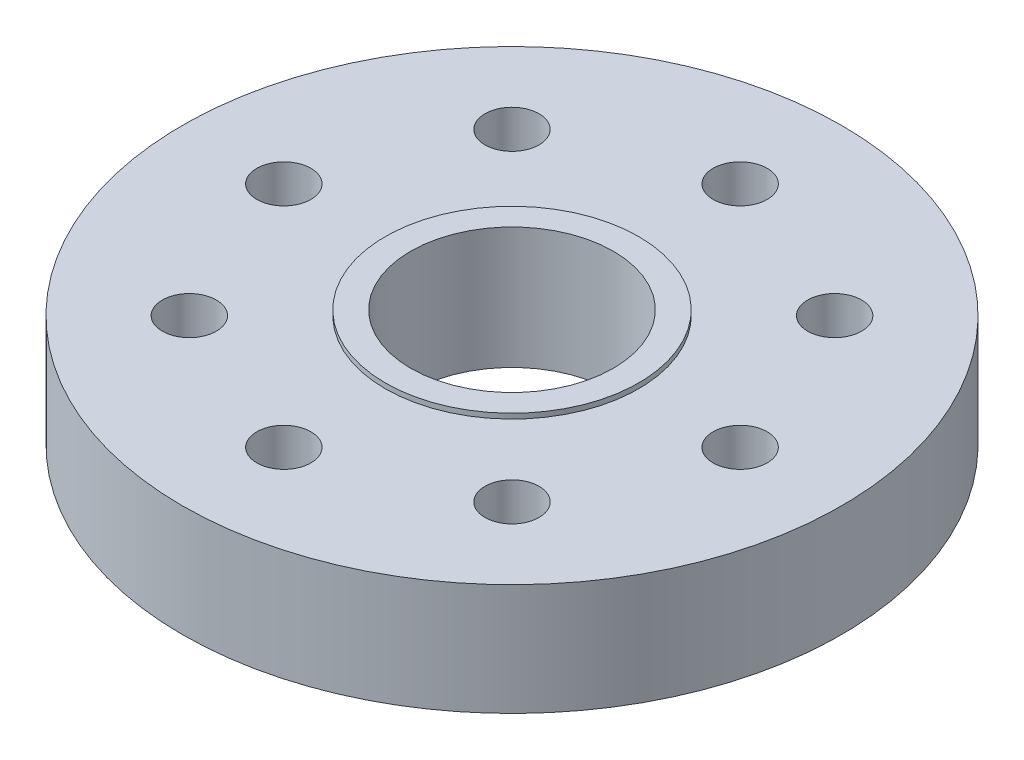
ISO-10303-21;
HEADER;
FILE_DESCRIPTION(('STEP AP214'),'2;1');
FILE_NAME('part.step','',(''),(''),'','','');
FILE_SCHEMA(('AUTOMOTIVE_DESIGN { 1 0 10303 214 1 1 1 1 }'));
ENDSEC;
DATA;
#1=APPLICATION_CONTEXT('core data for automotive mechanical design processes');
#2=APPLICATION_PROTOCOL_DEFINITION('international standard','automotive_design',2000,#1);
#3=PRODUCT_CONTEXT('',#1,'mechanical');
#4=PRODUCT('Part','Part','',(#3));
#5=PRODUCT_RELATED_PRODUCT_CATEGORY('part','',(#4));
#6=PRODUCT_DEFINITION_FORMATION('','',#4);
#7=PRODUCT_DEFINITION_CONTEXT('part definition',#1,'design');
#8=PRODUCT_DEFINITION('design','',#6,#7);
#9=PRODUCT_DEFINITION_SHAPE('','',#8);
#10=(LENGTH_UNIT() NAMED_UNIT(*) SI_UNIT(.MILLI.,.METRE.));
#11=(NAMED_UNIT(*) PLANE_ANGLE_UNIT() SI_UNIT($,.RADIAN.));
#12=(NAMED_UNIT(*) SI_UNIT($,.STERADIAN.) SOLID_ANGLE_UNIT());
#13=UNCERTAINTY_MEASURE_WITH_UNIT(LENGTH_MEASURE(1.E-05),#10,'distance_accuracy_value','');
#14=(GEOMETRIC_REPRESENTATION_CONTEXT(3) GLOBAL_UNCERTAINTY_ASSIGNED_CONTEXT((#13)) GLOBAL_UNIT_ASSIGNED_CONTEXT((#10,
#11,#12)) REPRESENTATION_CONTEXT('',''));
#15=CARTESIAN_POINT('',(0.,0.,0.));
#16=DIRECTION('',(0.,0.,1.));
#17=DIRECTION('',(1.,0.,0.));
#18=AXIS2_PLACEMENT_3D('',#15,#16,#17);
#19=CARTESIAN_POINT('',(0.,-1.65,0.));
#20=DIRECTION('',(0.,1.,0.));
#21=DIRECTION('',(0.,0.,1.));
#22=AXIS2_PLACEMENT_3D('',#19,#20,#21);
#23=PLANE('',#22);
#24=CARTESIAN_POINT('',(-4.7729707730092,-1.65,-4.7729707730092));
#25=DIRECTION('',(0.,1.,0.));
#26=DIRECTION('',(0.,0.,1.));
#27=AXIS2_PLACEMENT_3D('',#24,#25,#26);
#28=CIRCLE('',#27,0.8);
#29=CARTESIAN_POINT('',(-4.7729707730092,-1.65,-3.97297077300919));
#30=VERTEX_POINT('',#29);
#31=EDGE_CURVE('E264',#30,#30,#28,.T.);
#32=ORIENTED_EDGE('',*,*,#31,.T.);
#33=EDGE_LOOP('',(#32));
#34=FACE_BOUND('',#33,.T.);
#35=CARTESIAN_POINT('',(0.,-1.65,0.));
#36=DIRECTION('',(0.,-1.,0.));
#37=DIRECTION('',(0.,0.,-1.));
#38=AXIS2_PLACEMENT_3D('',#35,#36,#37);
#39=CIRCLE('',#38,4.4);
#40=CARTESIAN_POINT('',(-3.57052525047409,-1.65,-2.57125444787694));
#41=VERTEX_POINT('',#40);
#42=CARTESIAN_POINT('',(-3.02772373375921,-1.65,-3.19263041895413));
#43=VERTEX_POINT('',#42);
#44=EDGE_CURVE('E150',#41,#43,#39,.T.);
#45=ORIENTED_EDGE('',*,*,#44,.F.);
#46=CARTESIAN_POINT('',(-4.77297077300901,-1.65,-4.16941738241638));
#47=DIRECTION('',(0.,-1.,0.));
#48=DIRECTION('',(0.,0.,-1.));
#49=AXIS2_PLACEMENT_3D('',#46,#47,#48);
#50=CIRCLE('',#49,2.);
#51=EDGE_CURVE('E136',#41,#43,#50,.T.);
#52=ORIENTED_EDGE('',*,*,#51,.T.);
#53=EDGE_LOOP('',(#45,#52));
#54=FACE_BOUND('',#53,.T.);
#55=ADVANCED_FACE('F39',(#34,#54),#23,.F.);
#56=CARTESIAN_POINT('',(0.,-1.65,-6.75));
#57=DIRECTION('',(0.,1.,0.));
#58=DIRECTION('',(0.,0.,1.));
#59=AXIS2_PLACEMENT_3D('',#56,#57,#58);
#60=CIRCLE('',#59,0.8);
#61=CARTESIAN_POINT('',(0.,-1.65,-5.95));
#62=VERTEX_POINT('',#61);
#63=EDGE_CURVE('E273',#62,#62,#60,.T.);
#64=ORIENTED_EDGE('',*,*,#63,.T.);
#65=EDGE_LOOP('',(#64));
#66=FACE_BOUND('',#65,.T.);
#67=CARTESIAN_POINT('',(-0.571997114225685,-1.65,-4.36266195129963));
#68=VERTEX_POINT('',#67);
#69=CARTESIAN_POINT('',(0.327362601773109,-1.65,-4.38780511497039));
#70=VERTEX_POINT('',#69);
#71=EDGE_CURVE('E143',#68,#70,#39,.T.);
#72=ORIENTED_EDGE('',*,*,#71,.F.);
#73=CARTESIAN_POINT('',(-0.176776695296367,-1.65,-6.32322330470363));
#74=DIRECTION('',(0.,-1.,0.));
#75=DIRECTION('',(0.,0.,-1.));
#76=AXIS2_PLACEMENT_3D('',#73,#74,#75);
#77=CIRCLE('',#76,2.);
#78=EDGE_CURVE('E128',#68,#70,#77,.T.);
#79=ORIENTED_EDGE('',*,*,#78,.T.);
#80=EDGE_LOOP('',(#72,#79));
#81=FACE_BOUND('',#80,.T.);
#82=ADVANCED_FACE('F149',(#66,#81),#23,.F.);
#83=CARTESIAN_POINT('',(-6.75,-1.65,0.));
#84=DIRECTION('',(0.,1.,0.));
#85=DIRECTION('',(0.,0.,1.));
#86=AXIS2_PLACEMENT_3D('',#83,#84,#85);
#87=CIRCLE('',#86,0.800000000000001);
#88=CARTESIAN_POINT('',(-6.75,-1.65,0.800000000000001));
#89=VERTEX_POINT('',#88);
#90=EDGE_CURVE('E276',#89,#89,#87,.T.);
#91=ORIENTED_EDGE('',*,*,#90,.T.);
#92=EDGE_LOOP('',(#91));
#93=FACE_BOUND('',#92,.T.);
#94=CARTESIAN_POINT('',(-6.5,-1.65,0.603553390592734));
#95=DIRECTION('',(0.,-1.,0.));
#96=DIRECTION('',(0.,0.,-1.));
#97=AXIS2_PLACEMENT_3D('',#94,#95,#96);
#98=CIRCLE('',#97,2.);
#99=CARTESIAN_POINT('',(-6.5,-1.65,-1.39644660940727));
#100=VERTEX_POINT('',#99);
#101=EDGE_CURVE('E201',#100,#100,#98,.T.);
#102=ORIENTED_EDGE('',*,*,#101,.T.);
#103=EDGE_LOOP('',(#102));
#104=FACE_BOUND('',#103,.T.);
#105=ADVANCED_FACE('F293',(#93,#104),#23,.F.);
#106=CARTESIAN_POINT('',(0.,-1.65,0.));
#107=DIRECTION('',(0.,1.,0.));
#108=DIRECTION('',(0.,0.,1.));
#109=AXIS2_PLACEMENT_3D('',#106,#107,#108);
#110=CIRCLE('',#109,9.75);
#111=CARTESIAN_POINT('',(0.,-1.65,9.75));
#112=VERTEX_POINT('',#111);
#113=EDGE_CURVE('E43',#112,#112,#110,.T.);
#114=ORIENTED_EDGE('',*,*,#113,.F.);
#115=EDGE_LOOP('',(#114));
#116=FACE_BOUND('',#115,.T.);
#117=CARTESIAN_POINT('',(6.75,-1.65,0.));
#118=DIRECTION('',(0.,1.,0.));
#119=DIRECTION('',(0.,0.,1.));
#120=AXIS2_PLACEMENT_3D('',#117,#118,#119);
#121=CIRCLE('',#120,0.800000000000001);
#122=CARTESIAN_POINT('',(6.75,-1.65,0.800000000000001));
#123=VERTEX_POINT('',#122);
#124=EDGE_CURVE('E281',#123,#123,#121,.T.);
#125=ORIENTED_EDGE('',*,*,#124,.T.);
#126=EDGE_LOOP('',(#125));
#127=FACE_BOUND('',#126,.T.);
#128=CARTESIAN_POINT('',(0.,-1.65,6.75));
#129=DIRECTION('',(0.,1.,0.));
#130=DIRECTION('',(0.,0.,1.));
#131=AXIS2_PLACEMENT_3D('',#128,#129,#130);
#132=CIRCLE('',#131,0.8);
#133=CARTESIAN_POINT('',(0.,-1.65,7.55));
#134=VERTEX_POINT('',#133);
#135=EDGE_CURVE('E279',#134,#134,#132,.T.);
#136=ORIENTED_EDGE('',*,*,#135,.T.);
#137=EDGE_LOOP('',(#136));
#138=FACE_BOUND('',#137,.T.);
#139=CARTESIAN_POINT('',(4.7729707730092,-1.65,4.7729707730092));
#140=DIRECTION('',(0.,1.,0.));
#141=DIRECTION('',(0.,0.,1.));
#142=AXIS2_PLACEMENT_3D('',#139,#140,#141);
#143=CIRCLE('',#142,0.800000000000001);
#144=CARTESIAN_POINT('',(4.7729707730092,-1.65,5.5729707730092));
#145=VERTEX_POINT('',#144);
#146=EDGE_CURVE('E270',#145,#145,#143,.T.);
#147=ORIENTED_EDGE('',*,*,#146,.T.);
#148=EDGE_LOOP('',(#147));
#149=FACE_BOUND('',#148,.T.);
#150=CARTESIAN_POINT('',(-4.7729707730092,-1.65,4.7729707730092));
#151=DIRECTION('',(0.,1.,0.));
#152=DIRECTION('',(0.,0.,1.));
#153=AXIS2_PLACEMENT_3D('',#150,#151,#152);
#154=CIRCLE('',#153,0.8);
#155=CARTESIAN_POINT('',(-4.7729707730092,-1.65,5.5729707730092));
#156=VERTEX_POINT('',#155);
#157=EDGE_CURVE('E267',#156,#156,#154,.T.);
#158=ORIENTED_EDGE('',*,*,#157,.T.);
#159=EDGE_LOOP('',(#158));
#160=FACE_BOUND('',#159,.T.);
#161=CARTESIAN_POINT('',(5.022970773009,-1.65,4.77297077300912));
#162=DIRECTION('',(0.,-1.,0.));
#163=DIRECTION('',(0.,0.,-1.));
#164=AXIS2_PLACEMENT_3D('',#161,#162,#163);
#165=CIRCLE('',#164,2.);
#166=CARTESIAN_POINT('',(5.23241979418587,-1.65,6.76197331386422));
#167=VERTEX_POINT('',#166);
#168=CARTESIAN_POINT('',(7.02006772981787,-1.65,4.88069145396119));
#169=VERTEX_POINT('',#168);
#170=EDGE_CURVE('E56',#167,#169,#165,.T.);
#171=ORIENTED_EDGE('',*,*,#170,.T.);
#172=CARTESIAN_POINT('',(0.,-1.65,0.));
#173=DIRECTION('',(0.,-1.,0.));
#174=DIRECTION('',(0.,0.,-1.));
#175=AXIS2_PLACEMENT_3D('',#172,#173,#174);
#176=CIRCLE('',#175,8.55);
#177=CARTESIAN_POINT('',(8.49370370370371,-1.65,0.979539378325329));
#178=VERTEX_POINT('',#177);
#179=EDGE_CURVE('E190',#178,#169,#176,.T.);
#180=ORIENTED_EDGE('',*,*,#179,.F.);
#181=CARTESIAN_POINT('',(6.75,-1.65,0.));
#182=DIRECTION('',(0.,-1.,0.));
#183=DIRECTION('',(0.,0.,-1.));
#184=AXIS2_PLACEMENT_3D('',#181,#182,#183);
#185=CIRCLE('',#184,2.);
#186=CARTESIAN_POINT('',(8.49370370370371,-1.65,-0.979539378325329));
#187=VERTEX_POINT('',#186);
#188=EDGE_CURVE('E198',#178,#187,#185,.T.);
#189=ORIENTED_EDGE('',*,*,#188,.T.);
#190=CARTESIAN_POINT('',(-6.23877532911509,-1.65,5.8463819916958));
#191=VERTEX_POINT('',#190);
#192=EDGE_CURVE('E197',#191,#187,#176,.T.);
#193=ORIENTED_EDGE('',*,*,#192,.F.);
#194=CARTESIAN_POINT('',(-4.34619407771275,-1.65,5.19974746830537));
#195=DIRECTION('',(0.,-1.,0.));
#196=DIRECTION('',(0.,0.,-1.));
#197=AXIS2_PLACEMENT_3D('',#194,#195,#196);
#198=CIRCLE('',#197,2.);
#199=CARTESIAN_POINT('',(-4.64680378421073,-1.65,7.17702686291788));
#200=VERTEX_POINT('',#199);
#201=EDGE_CURVE('E194',#191,#200,#198,.T.);
#202=ORIENTED_EDGE('',*,*,#201,.T.);
#203=CARTESIAN_POINT('',(-0.790935859810123,-1.65,8.51333779816509));
#204=VERTEX_POINT('',#203);
#205=EDGE_CURVE('E191',#204,#200,#176,.T.);
#206=ORIENTED_EDGE('',*,*,#205,.F.);
#207=CARTESIAN_POINT('',(0.426776695296365,-1.65,6.92677669529637));
#208=DIRECTION('',(0.,-1.,0.));
#209=DIRECTION('',(0.,0.,-1.));
#210=AXIS2_PLACEMENT_3D('',#207,#208,#209);
#211=CIRCLE('',#210,2.);
#212=CARTESIAN_POINT('',(1.83004401429714,-1.65,8.3518524236085));
#213=VERTEX_POINT('',#212);
#214=EDGE_CURVE('E189',#204,#213,#211,.T.);
#215=ORIENTED_EDGE('',*,*,#214,.T.);
#216=EDGE_CURVE('E186',#167,#213,#176,.T.);
#217=ORIENTED_EDGE('',*,*,#216,.F.);
#218=EDGE_LOOP('',(#171,#180,#189,#193,#202,#206,#215,#217));
#219=FACE_BOUND('',#218,.T.);
#220=ADVANCED_FACE('F290',(#116,#127,#138,#149,#160,#219),#23,.F.);
#221=CARTESIAN_POINT('',(4.77297077300919,-1.65,-4.7729707730092));
#222=DIRECTION('',(0.,1.,0.));
#223=DIRECTION('',(0.,0.,1.));
#224=AXIS2_PLACEMENT_3D('',#221,#222,#223);
#225=CIRCLE('',#224,0.800000000000001);
#226=CARTESIAN_POINT('',(4.77297077300919,-1.65,-3.9729707730092));
#227=VERTEX_POINT('',#226);
#228=EDGE_CURVE('E238',#227,#227,#225,.T.);
#229=ORIENTED_EDGE('',*,*,#228,.T.);
#230=EDGE_LOOP('',(#229));
#231=FACE_BOUND('',#230,.T.);
#232=CARTESIAN_POINT('',(4.59619407771275,-1.65,-4.59619407771264));
#233=DIRECTION('',(0.,-1.,0.));
#234=DIRECTION('',(0.,0.,-1.));
#235=AXIS2_PLACEMENT_3D('',#232,#233,#234);
#236=CIRCLE('',#235,2.);
#237=CARTESIAN_POINT('',(4.59619407771275,-1.65,-6.59619407771264));
#238=VERTEX_POINT('',#237);
#239=EDGE_CURVE('E159',#238,#238,#236,.T.);
#240=ORIENTED_EDGE('',*,*,#239,.T.);
#241=EDGE_LOOP('',(#240));
#242=FACE_BOUND('',#241,.T.);
#243=ADVANCED_FACE('F292',(#231,#242),#23,.F.);
#244=CARTESIAN_POINT('',(0.,1.65,0.));
#245=DIRECTION('',(0.,-1.,0.));
#246=DIRECTION('',(0.,0.,-1.));
#247=AXIS2_PLACEMENT_3D('',#244,#245,#246);
#248=CYLINDRICAL_SURFACE('',#247,9.75);
#249=CARTESIAN_POINT('',(0.,1.65,0.));
#250=DIRECTION('',(0.,1.,0.));
#251=DIRECTION('',(0.,0.,1.));
#252=AXIS2_PLACEMENT_3D('',#249,#250,#251);
#253=CIRCLE('',#252,9.75);
#254=CARTESIAN_POINT('',(0.,1.65,9.75));
#255=VERTEX_POINT('',#254);
#256=EDGE_CURVE('E11',#255,#255,#253,.T.);
#257=ORIENTED_EDGE('',*,*,#256,.F.);
#258=EDGE_LOOP('',(#257));
#259=FACE_BOUND('',#258,.T.);
#260=ORIENTED_EDGE('',*,*,#113,.T.);
#261=EDGE_LOOP('',(#260));
#262=FACE_BOUND('',#261,.T.);
#263=ADVANCED_FACE('F288',(#259,#262),#248,.T.);
#264=CARTESIAN_POINT('',(6.75,1.65,0.));
#265=DIRECTION('',(0.,-1.,0.));
#266=DIRECTION('',(0.,0.,-1.));
#267=AXIS2_PLACEMENT_3D('',#264,#265,#266);
#268=CYLINDRICAL_SURFACE('',#267,0.800000000000001);
#269=CARTESIAN_POINT('',(6.75,1.65,0.));
#270=DIRECTION('',(0.,1.,0.));
#271=DIRECTION('',(0.,0.,1.));
#272=AXIS2_PLACEMENT_3D('',#269,#270,#271);
#273=CIRCLE('',#272,0.800000000000001);
#274=CARTESIAN_POINT('',(6.75,1.65,0.800000000000001));
#275=VERTEX_POINT('',#274);
#276=EDGE_CURVE('E48',#275,#275,#273,.T.);
#277=ORIENTED_EDGE('',*,*,#276,.T.);
#278=EDGE_LOOP('',(#277));
#279=FACE_BOUND('',#278,.T.);
#280=ORIENTED_EDGE('',*,*,#124,.F.);
#281=EDGE_LOOP('',(#280));
#282=FACE_BOUND('',#281,.T.);
#283=ADVANCED_FACE('F375',(#279,#282),#268,.F.);
#284=CARTESIAN_POINT('',(0.,1.65,6.75));
#285=DIRECTION('',(0.,-1.,0.));
#286=DIRECTION('',(0.,0.,-1.));
#287=AXIS2_PLACEMENT_3D('',#284,#285,#286);
#288=CYLINDRICAL_SURFACE('',#287,0.8);
#289=CARTESIAN_POINT('',(0.,1.65,6.75));
#290=DIRECTION('',(0.,1.,0.));
#291=DIRECTION('',(0.,0.,1.));
#292=AXIS2_PLACEMENT_3D('',#289,#290,#291);
#293=CIRCLE('',#292,0.8);
#294=CARTESIAN_POINT('',(0.,1.65,7.55));
#295=VERTEX_POINT('',#294);
#296=EDGE_CURVE('E257',#295,#295,#293,.T.);
#297=ORIENTED_EDGE('',*,*,#296,.T.);
#298=EDGE_LOOP('',(#297));
#299=FACE_BOUND('',#298,.T.);
#300=ORIENTED_EDGE('',*,*,#135,.F.);
#301=EDGE_LOOP('',(#300));
#302=FACE_BOUND('',#301,.T.);
#303=ADVANCED_FACE('F455',(#299,#302),#288,.F.);
#304=CARTESIAN_POINT('',(-6.75,1.65,0.));
#305=DIRECTION('',(0.,-1.,0.));
#306=DIRECTION('',(0.,0.,-1.));
#307=AXIS2_PLACEMENT_3D('',#304,#305,#306);
#308=CYLINDRICAL_SURFACE('',#307,0.800000000000001);
#309=CARTESIAN_POINT('',(-6.75,1.65,0.));
#310=DIRECTION('',(0.,1.,0.));
#311=DIRECTION('',(0.,0.,1.));
#312=AXIS2_PLACEMENT_3D('',#309,#310,#311);
#313=CIRCLE('',#312,0.800000000000001);
#314=CARTESIAN_POINT('',(-6.75,1.65,0.800000000000001));
#315=VERTEX_POINT('',#314);
#316=EDGE_CURVE('E254',#315,#315,#313,.T.);
#317=ORIENTED_EDGE('',*,*,#316,.T.);
#318=EDGE_LOOP('',(#317));
#319=FACE_BOUND('',#318,.T.);
#320=ORIENTED_EDGE('',*,*,#90,.F.);
#321=EDGE_LOOP('',(#320));
#322=FACE_BOUND('',#321,.T.);
#323=ADVANCED_FACE('F460',(#319,#322),#308,.F.);
#324=CARTESIAN_POINT('',(0.,1.65,-6.75));
#325=DIRECTION('',(0.,-1.,0.));
#326=DIRECTION('',(0.,0.,-1.));
#327=AXIS2_PLACEMENT_3D('',#324,#325,#326);
#328=CYLINDRICAL_SURFACE('',#327,0.8);
#329=CARTESIAN_POINT('',(0.,1.65,-6.75));
#330=DIRECTION('',(0.,1.,0.));
#331=DIRECTION('',(0.,0.,1.));
#332=AXIS2_PLACEMENT_3D('',#329,#330,#331);
#333=CIRCLE('',#332,0.8);
#334=CARTESIAN_POINT('',(0.,1.65,-5.95));
#335=VERTEX_POINT('',#334);
#336=EDGE_CURVE('E251',#335,#335,#333,.T.);
#337=ORIENTED_EDGE('',*,*,#336,.T.);
#338=EDGE_LOOP('',(#337));
#339=FACE_BOUND('',#338,.T.);
#340=ORIENTED_EDGE('',*,*,#63,.F.);
#341=EDGE_LOOP('',(#340));
#342=FACE_BOUND('',#341,.T.);
#343=ADVANCED_FACE('F466',(#339,#342),#328,.F.);
#344=CARTESIAN_POINT('',(4.7729707730092,1.65,4.7729707730092));
#345=DIRECTION('',(0.,-1.,0.));
#346=DIRECTION('',(0.,0.,-1.));
#347=AXIS2_PLACEMENT_3D('',#344,#345,#346);
#348=CYLINDRICAL_SURFACE('',#347,0.800000000000001);
#349=CARTESIAN_POINT('',(4.7729707730092,1.65,4.7729707730092));
#350=DIRECTION('',(0.,1.,0.));
#351=DIRECTION('',(0.,0.,1.));
#352=AXIS2_PLACEMENT_3D('',#349,#350,#351);
#353=CIRCLE('',#352,0.800000000000001);
#354=CARTESIAN_POINT('',(4.7729707730092,1.65,5.5729707730092));
#355=VERTEX_POINT('',#354);
#356=EDGE_CURVE('E248',#355,#355,#353,.T.);
#357=ORIENTED_EDGE('',*,*,#356,.T.);
#358=EDGE_LOOP('',(#357));
#359=FACE_BOUND('',#358,.T.);
#360=ORIENTED_EDGE('',*,*,#146,.F.);
#361=EDGE_LOOP('',(#360));
#362=FACE_BOUND('',#361,.T.);
#363=ADVANCED_FACE('F470',(#359,#362),#348,.F.);
#364=CARTESIAN_POINT('',(-4.7729707730092,1.65,4.7729707730092));
#365=DIRECTION('',(0.,-1.,0.));
#366=DIRECTION('',(0.,0.,-1.));
#367=AXIS2_PLACEMENT_3D('',#364,#365,#366);
#368=CYLINDRICAL_SURFACE('',#367,0.8);
#369=CARTESIAN_POINT('',(-4.7729707730092,1.65,4.7729707730092));
#370=DIRECTION('',(0.,1.,0.));
#371=DIRECTION('',(0.,0.,1.));
#372=AXIS2_PLACEMENT_3D('',#369,#370,#371);
#373=CIRCLE('',#372,0.8);
#374=CARTESIAN_POINT('',(-4.7729707730092,1.65,5.5729707730092));
#375=VERTEX_POINT('',#374);
#376=EDGE_CURVE('E245',#375,#375,#373,.T.);
#377=ORIENTED_EDGE('',*,*,#376,.T.);
#378=EDGE_LOOP('',(#377));
#379=FACE_BOUND('',#378,.T.);
#380=ORIENTED_EDGE('',*,*,#157,.F.);
#381=EDGE_LOOP('',(#380));
#382=FACE_BOUND('',#381,.T.);
#383=ADVANCED_FACE('F474',(#379,#382),#368,.F.);
#384=CARTESIAN_POINT('',(-4.7729707730092,1.65,-4.7729707730092));
#385=DIRECTION('',(0.,-1.,0.));
#386=DIRECTION('',(0.,0.,-1.));
#387=AXIS2_PLACEMENT_3D('',#384,#385,#386);
#388=CYLINDRICAL_SURFACE('',#387,0.8);
#389=CARTESIAN_POINT('',(-4.7729707730092,1.65,-4.7729707730092));
#390=DIRECTION('',(0.,1.,0.));
#391=DIRECTION('',(0.,0.,1.));
#392=AXIS2_PLACEMENT_3D('',#389,#390,#391);
#393=CIRCLE('',#392,0.8);
#394=CARTESIAN_POINT('',(-4.7729707730092,1.65,-3.97297077300919));
#395=VERTEX_POINT('',#394);
#396=EDGE_CURVE('E242',#395,#395,#393,.T.);
#397=ORIENTED_EDGE('',*,*,#396,.T.);
#398=EDGE_LOOP('',(#397));
#399=FACE_BOUND('',#398,.T.);
#400=ORIENTED_EDGE('',*,*,#31,.F.);
#401=EDGE_LOOP('',(#400));
#402=FACE_BOUND('',#401,.T.);
#403=ADVANCED_FACE('F431',(#399,#402),#388,.F.);
#404=CARTESIAN_POINT('',(4.77297077300919,1.65,-4.7729707730092));
#405=DIRECTION('',(0.,-1.,0.));
#406=DIRECTION('',(0.,0.,-1.));
#407=AXIS2_PLACEMENT_3D('',#404,#405,#406);
#408=CYLINDRICAL_SURFACE('',#407,0.800000000000001);
#409=CARTESIAN_POINT('',(4.77297077300919,1.65,-4.7729707730092));
#410=DIRECTION('',(0.,1.,0.));
#411=DIRECTION('',(0.,0.,1.));
#412=AXIS2_PLACEMENT_3D('',#409,#410,#411);
#413=CIRCLE('',#412,0.800000000000001);
#414=CARTESIAN_POINT('',(4.77297077300919,1.65,-3.9729707730092));
#415=VERTEX_POINT('',#414);
#416=EDGE_CURVE('E239',#415,#415,#413,.T.);
#417=ORIENTED_EDGE('',*,*,#416,.T.);
#418=EDGE_LOOP('',(#417));
#419=FACE_BOUND('',#418,.T.);
#420=ORIENTED_EDGE('',*,*,#228,.F.);
#421=EDGE_LOOP('',(#420));
#422=FACE_BOUND('',#421,.T.);
#423=ADVANCED_FACE('F41',(#419,#422),#408,.F.);
#424=CARTESIAN_POINT('',(0.,1.65,0.));
#425=DIRECTION('',(0.,1.,0.));
#426=DIRECTION('',(0.,0.,1.));
#427=AXIS2_PLACEMENT_3D('',#424,#425,#426);
#428=PLANE('',#427);
#429=CARTESIAN_POINT('',(0.,1.65,0.));
#430=DIRECTION('',(0.,1.,0.));
#431=DIRECTION('',(0.,0.,1.));
#432=AXIS2_PLACEMENT_3D('',#429,#430,#431);
#433=CIRCLE('',#432,3.75);
#434=CARTESIAN_POINT('',(0.,1.65,3.75));
#435=VERTEX_POINT('',#434);
#436=EDGE_CURVE('E233',#435,#435,#433,.F.);
#437=ORIENTED_EDGE('',*,*,#436,.T.);
#438=EDGE_LOOP('',(#437));
#439=FACE_BOUND('',#438,.T.);
#440=ORIENTED_EDGE('',*,*,#416,.F.);
#441=EDGE_LOOP('',(#440));
#442=FACE_BOUND('',#441,.T.);
#443=ORIENTED_EDGE('',*,*,#396,.F.);
#444=EDGE_LOOP('',(#443));
#445=FACE_BOUND('',#444,.T.);
#446=ORIENTED_EDGE('',*,*,#376,.F.);
#447=EDGE_LOOP('',(#446));
#448=FACE_BOUND('',#447,.T.);
#449=ORIENTED_EDGE('',*,*,#356,.F.);
#450=EDGE_LOOP('',(#449));
#451=FACE_BOUND('',#450,.T.);
#452=ORIENTED_EDGE('',*,*,#336,.F.);
#453=EDGE_LOOP('',(#452));
#454=FACE_BOUND('',#453,.T.);
#455=ORIENTED_EDGE('',*,*,#316,.F.);
#456=EDGE_LOOP('',(#455));
#457=FACE_BOUND('',#456,.T.);
#458=ORIENTED_EDGE('',*,*,#296,.F.);
#459=EDGE_LOOP('',(#458));
#460=FACE_BOUND('',#459,.T.);
#461=ORIENTED_EDGE('',*,*,#276,.F.);
#462=EDGE_LOOP('',(#461));
#463=FACE_BOUND('',#462,.T.);
#464=ORIENTED_EDGE('',*,*,#256,.T.);
#465=EDGE_LOOP('',(#464));
#466=FACE_BOUND('',#465,.T.);
#467=ADVANCED_FACE('F422',(#439,#442,#445,#448,#451,#454,#457,#460,#463,#466),#428,.T.);
#468=CARTESIAN_POINT('',(0.,-1.8,0.));
#469=DIRECTION('',(0.,1.,0.));
#470=DIRECTION('',(0.,0.,1.));
#471=AXIS2_PLACEMENT_3D('',#468,#469,#470);
#472=PLANE('',#471);
#473=CARTESIAN_POINT('',(0.,-1.8,0.));
#474=DIRECTION('',(0.,1.,0.));
#475=DIRECTION('',(0.,0.,1.));
#476=AXIS2_PLACEMENT_3D('',#473,#474,#475);
#477=CIRCLE('',#476,3.);
#478=CARTESIAN_POINT('',(0.,-1.8,3.));
#479=VERTEX_POINT('',#478);
#480=EDGE_CURVE('E208',#479,#479,#477,.T.);
#481=ORIENTED_EDGE('',*,*,#480,.T.);
#482=EDGE_LOOP('',(#481));
#483=FACE_BOUND('',#482,.T.);
#484=CARTESIAN_POINT('',(0.,-1.8,0.));
#485=DIRECTION('',(0.,-1.,0.));
#486=DIRECTION('',(0.,0.,-1.));
#487=AXIS2_PLACEMENT_3D('',#484,#485,#486);
#488=CIRCLE('',#487,4.4);
#489=CARTESIAN_POINT('',(0.,-1.8,-4.4));
#490=VERTEX_POINT('',#489);
#491=EDGE_CURVE('E137',#490,#490,#488,.T.);
#492=ORIENTED_EDGE('',*,*,#491,.T.);
#493=EDGE_LOOP('',(#492));
#494=FACE_BOUND('',#493,.T.);
#495=ADVANCED_FACE('F418',(#483,#494),#472,.F.);
#496=CARTESIAN_POINT('',(0.,1.65,0.));
#497=DIRECTION('',(0.,-1.,0.));
#498=DIRECTION('',(0.,0.,-1.));
#499=AXIS2_PLACEMENT_3D('',#496,#497,#498);
#500=CYLINDRICAL_SURFACE('',#499,3.);
#501=ORIENTED_EDGE('',*,*,#480,.F.);
#502=EDGE_LOOP('',(#501));
#503=FACE_BOUND('',#502,.T.);
#504=CARTESIAN_POINT('',(0.,1.8,0.));
#505=DIRECTION('',(0.,1.,0.));
#506=DIRECTION('',(0.,0.,1.));
#507=AXIS2_PLACEMENT_3D('',#504,#505,#506);
#508=CIRCLE('',#507,3.);
#509=CARTESIAN_POINT('',(0.,1.8,3.));
#510=VERTEX_POINT('',#509);
#511=EDGE_CURVE('E227',#510,#510,#508,.T.);
#512=ORIENTED_EDGE('',*,*,#511,.T.);
#513=EDGE_LOOP('',(#512));
#514=FACE_BOUND('',#513,.T.);
#515=ADVANCED_FACE('F421',(#503,#514),#500,.F.);
#516=CARTESIAN_POINT('',(0.,1.8,0.));
#517=DIRECTION('',(0.,-1.,0.));
#518=DIRECTION('',(0.,0.,-1.));
#519=AXIS2_PLACEMENT_3D('',#516,#517,#518);
#520=CYLINDRICAL_SURFACE('',#519,3.75);
#521=ORIENTED_EDGE('',*,*,#436,.F.);
#522=EDGE_LOOP('',(#521));
#523=FACE_BOUND('',#522,.T.);
#524=CARTESIAN_POINT('',(0.,1.8,0.));
#525=DIRECTION('',(0.,1.,0.));
#526=DIRECTION('',(0.,0.,1.));
#527=AXIS2_PLACEMENT_3D('',#524,#525,#526);
#528=CIRCLE('',#527,3.75);
#529=CARTESIAN_POINT('',(0.,1.8,3.75));
#530=VERTEX_POINT('',#529);
#531=EDGE_CURVE('E230',#530,#530,#528,.T.);
#532=ORIENTED_EDGE('',*,*,#531,.F.);
#533=EDGE_LOOP('',(#532));
#534=FACE_BOUND('',#533,.T.);
#535=ADVANCED_FACE('F416',(#523,#534),#520,.T.);
#536=CARTESIAN_POINT('',(0.,1.8,0.));
#537=DIRECTION('',(0.,1.,0.));
#538=DIRECTION('',(0.,0.,1.));
#539=AXIS2_PLACEMENT_3D('',#536,#537,#538);
#540=PLANE('',#539);
#541=ORIENTED_EDGE('',*,*,#511,.F.);
#542=EDGE_LOOP('',(#541));
#543=FACE_BOUND('',#542,.T.);
#544=ORIENTED_EDGE('',*,*,#531,.T.);
#545=EDGE_LOOP('',(#544));
#546=FACE_BOUND('',#545,.T.);
#547=ADVANCED_FACE('F350',(#543,#546),#540,.T.);
#548=CARTESIAN_POINT('',(5.022970773009,0.15,4.77297077300912));
#549=DIRECTION('',(0.,-1.,0.));
#550=DIRECTION('',(0.,0.,-1.));
#551=AXIS2_PLACEMENT_3D('',#548,#549,#550);
#552=CYLINDRICAL_SURFACE('',#551,2.);
#553=ORIENTED_EDGE('',*,*,#170,.F.);
#554=DIRECTION('',(0.,-1.,0.));
#555=VECTOR('',#554,1.);
#556=CARTESIAN_POINT('',(5.23241979418587,0.15,6.76197331386422));
#557=LINE('',#556,#555);
#558=CARTESIAN_POINT('',(5.23241979418587,0.15,6.76197331386422));
#559=VERTEX_POINT('',#558);
#560=EDGE_CURVE('E221',#559,#167,#557,.T.);
#561=ORIENTED_EDGE('',*,*,#560,.F.);
#562=CARTESIAN_POINT('',(5.022970773009,0.15,4.77297077300912));
#563=DIRECTION('',(0.,-1.,0.));
#564=DIRECTION('',(0.,0.,-1.));
#565=AXIS2_PLACEMENT_3D('',#562,#563,#564);
#566=CIRCLE('',#565,2.);
#567=CARTESIAN_POINT('',(7.02006772981787,0.15,4.88069145396119));
#568=VERTEX_POINT('',#567);
#569=EDGE_CURVE('E163',#559,#568,#566,.T.);
#570=ORIENTED_EDGE('',*,*,#569,.T.);
#571=DIRECTION('',(0.,-1.,0.));
#572=VECTOR('',#571,1.);
#573=CARTESIAN_POINT('',(7.02006772981787,0.15,4.88069145396119));
#574=LINE('',#573,#572);
#575=EDGE_CURVE('E206',#568,#169,#574,.T.);
#576=ORIENTED_EDGE('',*,*,#575,.T.);
#577=EDGE_LOOP('',(#553,#561,#570,#576));
#578=FACE_BOUND('',#577,.T.);
#579=ADVANCED_FACE('F312',(#578),#552,.T.);
#580=CARTESIAN_POINT('',(0.,0.15,0.));
#581=DIRECTION('',(0.,-1.,0.));
#582=DIRECTION('',(0.,0.,-1.));
#583=AXIS2_PLACEMENT_3D('',#580,#581,#582);
#584=CYLINDRICAL_SURFACE('',#583,8.55);
#585=ORIENTED_EDGE('',*,*,#179,.T.);
#586=ORIENTED_EDGE('',*,*,#575,.F.);
#587=CARTESIAN_POINT('',(0.,0.15,0.));
#588=DIRECTION('',(0.,-1.,0.));
#589=DIRECTION('',(0.,0.,-1.));
#590=AXIS2_PLACEMENT_3D('',#587,#588,#589);
#591=CIRCLE('',#590,8.55);
#592=CARTESIAN_POINT('',(8.49370370370371,0.15,0.979539378325329));
#593=VERTEX_POINT('',#592);
#594=EDGE_CURVE('E169',#593,#568,#591,.T.);
#595=ORIENTED_EDGE('',*,*,#594,.F.);
#596=DIRECTION('',(0.,-1.,0.));
#597=VECTOR('',#596,1.);
#598=CARTESIAN_POINT('',(8.49370370370371,0.15,0.979539378325329));
#599=LINE('',#598,#597);
#600=EDGE_CURVE('E209',#593,#178,#599,.T.);
#601=ORIENTED_EDGE('',*,*,#600,.T.);
#602=EDGE_LOOP('',(#585,#586,#595,#601));
#603=FACE_BOUND('',#602,.T.);
#604=ADVANCED_FACE('F342',(#603),#584,.F.);
#605=CARTESIAN_POINT('',(6.75,0.15,0.));
#606=DIRECTION('',(0.,-1.,0.));
#607=DIRECTION('',(0.,0.,-1.));
#608=AXIS2_PLACEMENT_3D('',#605,#606,#607);
#609=CYLINDRICAL_SURFACE('',#608,2.);
#610=ORIENTED_EDGE('',*,*,#188,.F.);
#611=ORIENTED_EDGE('',*,*,#600,.F.);
#612=CARTESIAN_POINT('',(6.75,0.15,0.));
#613=DIRECTION('',(0.,-1.,0.));
#614=DIRECTION('',(0.,0.,-1.));
#615=AXIS2_PLACEMENT_3D('',#612,#613,#614);
#616=CIRCLE('',#615,2.);
#617=CARTESIAN_POINT('',(8.49370370370371,0.15,-0.979539378325329));
#618=VERTEX_POINT('',#617);
#619=EDGE_CURVE('E175',#593,#618,#616,.T.);
#620=ORIENTED_EDGE('',*,*,#619,.T.);
#621=DIRECTION('',(0.,-1.,0.));
#622=VECTOR('',#621,1.);
#623=CARTESIAN_POINT('',(8.49370370370371,0.15,-0.979539378325329));
#624=LINE('',#623,#622);
#625=EDGE_CURVE('E211',#618,#187,#624,.T.);
#626=ORIENTED_EDGE('',*,*,#625,.T.);
#627=EDGE_LOOP('',(#610,#611,#620,#626));
#628=FACE_BOUND('',#627,.T.);
#629=ADVANCED_FACE('F341',(#628),#609,.T.);
#630=ORIENTED_EDGE('',*,*,#192,.T.);
#631=ORIENTED_EDGE('',*,*,#625,.F.);
#632=CARTESIAN_POINT('',(-6.23877532911509,0.15,5.8463819916958));
#633=VERTEX_POINT('',#632);
#634=EDGE_CURVE('E174',#633,#618,#591,.T.);
#635=ORIENTED_EDGE('',*,*,#634,.F.);
#636=DIRECTION('',(0.,-1.,0.));
#637=VECTOR('',#636,1.);
#638=CARTESIAN_POINT('',(-6.23877532911509,0.15,5.8463819916958));
#639=LINE('',#638,#637);
#640=EDGE_CURVE('E213',#633,#191,#639,.T.);
#641=ORIENTED_EDGE('',*,*,#640,.T.);
#642=EDGE_LOOP('',(#630,#631,#635,#641));
#643=FACE_BOUND('',#642,.T.);
#644=ADVANCED_FACE('F337',(#643),#584,.F.);
#645=CARTESIAN_POINT('',(-4.34619407771275,0.15,5.19974746830537));
#646=DIRECTION('',(0.,-1.,0.));
#647=DIRECTION('',(0.,0.,-1.));
#648=AXIS2_PLACEMENT_3D('',#645,#646,#647);
#649=CYLINDRICAL_SURFACE('',#648,2.);
#650=ORIENTED_EDGE('',*,*,#201,.F.);
#651=ORIENTED_EDGE('',*,*,#640,.F.);
#652=CARTESIAN_POINT('',(-4.34619407771275,0.15,5.19974746830537));
#653=DIRECTION('',(0.,-1.,0.));
#654=DIRECTION('',(0.,0.,-1.));
#655=AXIS2_PLACEMENT_3D('',#652,#653,#654);
#656=CIRCLE('',#655,2.);
#657=CARTESIAN_POINT('',(-4.64680378421073,0.15,7.17702686291788));
#658=VERTEX_POINT('',#657);
#659=EDGE_CURVE('E172',#633,#658,#656,.T.);
#660=ORIENTED_EDGE('',*,*,#659,.T.);
#661=DIRECTION('',(0.,-1.,0.));
#662=VECTOR('',#661,1.);
#663=CARTESIAN_POINT('',(-4.64680378421073,0.15,7.17702686291788));
#664=LINE('',#663,#662);
#665=EDGE_CURVE('E215',#658,#200,#664,.T.);
#666=ORIENTED_EDGE('',*,*,#665,.T.);
#667=EDGE_LOOP('',(#650,#651,#660,#666));
#668=FACE_BOUND('',#667,.T.);
#669=ADVANCED_FACE('F333',(#668),#649,.T.);
#670=ORIENTED_EDGE('',*,*,#205,.T.);
#671=ORIENTED_EDGE('',*,*,#665,.F.);
#672=CARTESIAN_POINT('',(-0.790935859810123,0.15,8.51333779816509));
#673=VERTEX_POINT('',#672);
#674=EDGE_CURVE('E170',#673,#658,#591,.T.);
#675=ORIENTED_EDGE('',*,*,#674,.F.);
#676=DIRECTION('',(0.,-1.,0.));
#677=VECTOR('',#676,1.);
#678=CARTESIAN_POINT('',(-0.790935859810123,0.15,8.51333779816509));
#679=LINE('',#678,#677);
#680=EDGE_CURVE('E217',#673,#204,#679,.T.);
#681=ORIENTED_EDGE('',*,*,#680,.T.);
#682=EDGE_LOOP('',(#670,#671,#675,#681));
#683=FACE_BOUND('',#682,.T.);
#684=ADVANCED_FACE('F330',(#683),#584,.F.);
#685=CARTESIAN_POINT('',(0.426776695296365,0.15,6.92677669529637));
#686=DIRECTION('',(0.,-1.,0.));
#687=DIRECTION('',(0.,0.,-1.));
#688=AXIS2_PLACEMENT_3D('',#685,#686,#687);
#689=CYLINDRICAL_SURFACE('',#688,2.);
#690=ORIENTED_EDGE('',*,*,#214,.F.);
#691=ORIENTED_EDGE('',*,*,#680,.F.);
#692=CARTESIAN_POINT('',(0.426776695296365,0.15,6.92677669529637));
#693=DIRECTION('',(0.,-1.,0.));
#694=DIRECTION('',(0.,0.,-1.));
#695=AXIS2_PLACEMENT_3D('',#692,#693,#694);
#696=CIRCLE('',#695,2.);
#697=CARTESIAN_POINT('',(1.83004401429714,0.15,8.3518524236085));
#698=VERTEX_POINT('',#697);
#699=EDGE_CURVE('E168',#673,#698,#696,.T.);
#700=ORIENTED_EDGE('',*,*,#699,.T.);
#701=DIRECTION('',(0.,-1.,0.));
#702=VECTOR('',#701,1.);
#703=CARTESIAN_POINT('',(1.83004401429714,0.15,8.3518524236085));
#704=LINE('',#703,#702);
#705=EDGE_CURVE('E219',#698,#213,#704,.T.);
#706=ORIENTED_EDGE('',*,*,#705,.T.);
#707=EDGE_LOOP('',(#690,#691,#700,#706));
#708=FACE_BOUND('',#707,.T.);
#709=ADVANCED_FACE('F409',(#708),#689,.T.);
#710=CARTESIAN_POINT('',(0.,0.15,0.));
#711=DIRECTION('',(0.,-1.,0.));
#712=DIRECTION('',(0.,0.,-1.));
#713=AXIS2_PLACEMENT_3D('',#710,#711,#712);
#714=CYLINDRICAL_SURFACE('',#713,4.4);
#715=DIRECTION('',(0.,-1.,0.));
#716=VECTOR('',#715,1.);
#717=CARTESIAN_POINT('',(-3.57052525047409,0.15,-2.57125444787694));
#718=LINE('',#717,#716);
#719=CARTESIAN_POINT('',(-3.57052525047409,0.15,-2.57125444787694));
#720=VERTEX_POINT('',#719);
#721=EDGE_CURVE('E223',#720,#41,#718,.T.);
#722=ORIENTED_EDGE('',*,*,#721,.T.);
#723=ORIENTED_EDGE('',*,*,#44,.T.);
#724=DIRECTION('',(0.,-1.,0.));
#725=VECTOR('',#724,1.);
#726=CARTESIAN_POINT('',(-3.02772373375921,0.15,-3.19263041895413));
#727=LINE('',#726,#725);
#728=CARTESIAN_POINT('',(-3.02772373375921,0.15,-3.19263041895413));
#729=VERTEX_POINT('',#728);
#730=EDGE_CURVE('E147',#729,#43,#727,.T.);
#731=ORIENTED_EDGE('',*,*,#730,.F.);
#732=CARTESIAN_POINT('',(0.,0.15,0.));
#733=DIRECTION('',(0.,-1.,0.));
#734=DIRECTION('',(0.,0.,-1.));
#735=AXIS2_PLACEMENT_3D('',#732,#733,#734);
#736=CIRCLE('',#735,4.4);
#737=CARTESIAN_POINT('',(-0.571997114225681,0.15,-4.36266195129963));
#738=VERTEX_POINT('',#737);
#739=EDGE_CURVE('E146',#729,#738,#736,.T.);
#740=ORIENTED_EDGE('',*,*,#739,.T.);
#741=DIRECTION('',(0.,-1.,0.));
#742=VECTOR('',#741,1.);
#743=CARTESIAN_POINT('',(-0.571997114225681,0.15,-4.36266195129963));
#744=LINE('',#743,#742);
#745=EDGE_CURVE('E131',#738,#68,#744,.T.);
#746=ORIENTED_EDGE('',*,*,#745,.T.);
#747=ORIENTED_EDGE('',*,*,#71,.T.);
#748=DIRECTION('',(0.,-1.,0.));
#749=VECTOR('',#748,1.);
#750=CARTESIAN_POINT('',(0.327362601773109,0.15,-4.38780511497039));
#751=LINE('',#750,#749);
#752=CARTESIAN_POINT('',(0.327362601773109,0.15,-4.38780511497039));
#753=VERTEX_POINT('',#752);
#754=EDGE_CURVE('E64',#753,#70,#751,.T.);
#755=ORIENTED_EDGE('',*,*,#754,.F.);
#756=EDGE_CURVE('E155',#753,#720,#736,.T.);
#757=ORIENTED_EDGE('',*,*,#756,.T.);
#758=EDGE_LOOP('',(#722,#723,#731,#740,#746,#747,#755,#757));
#759=FACE_BOUND('',#758,.T.);
#760=ORIENTED_EDGE('',*,*,#491,.F.);
#761=EDGE_LOOP('',(#760));
#762=FACE_BOUND('',#761,.T.);
#763=ADVANCED_FACE('F141',(#759,#762),#714,.T.);
#764=CARTESIAN_POINT('',(-4.77297077300901,0.15,-4.16941738241638));
#765=DIRECTION('',(0.,-1.,0.));
#766=DIRECTION('',(0.,0.,-1.));
#767=AXIS2_PLACEMENT_3D('',#764,#765,#766);
#768=CYLINDRICAL_SURFACE('',#767,2.);
#769=ORIENTED_EDGE('',*,*,#51,.F.);
#770=ORIENTED_EDGE('',*,*,#721,.F.);
#771=CARTESIAN_POINT('',(-4.77297077300901,0.15,-4.16941738241638));
#772=DIRECTION('',(0.,-1.,0.));
#773=DIRECTION('',(0.,0.,-1.));
#774=AXIS2_PLACEMENT_3D('',#771,#772,#773);
#775=CIRCLE('',#774,2.);
#776=EDGE_CURVE('E161',#720,#729,#775,.T.);
#777=ORIENTED_EDGE('',*,*,#776,.T.);
#778=ORIENTED_EDGE('',*,*,#730,.T.);
#779=EDGE_LOOP('',(#769,#770,#777,#778));
#780=FACE_BOUND('',#779,.T.);
#781=ADVANCED_FACE('F394',(#780),#768,.T.);
#782=CARTESIAN_POINT('',(-6.5,0.15,0.603553390592734));
#783=DIRECTION('',(0.,-1.,0.));
#784=DIRECTION('',(0.,0.,-1.));
#785=AXIS2_PLACEMENT_3D('',#782,#783,#784);
#786=CYLINDRICAL_SURFACE('',#785,2.);
#787=CARTESIAN_POINT('',(-6.5,0.15,0.603553390592734));
#788=DIRECTION('',(0.,-1.,0.));
#789=DIRECTION('',(0.,0.,-1.));
#790=AXIS2_PLACEMENT_3D('',#787,#788,#789);
#791=CIRCLE('',#790,2.);
#792=CARTESIAN_POINT('',(-6.5,0.15,-1.39644660940727));
#793=VERTEX_POINT('',#792);
#794=EDGE_CURVE('E177',#793,#793,#791,.T.);
#795=ORIENTED_EDGE('',*,*,#794,.T.);
#796=EDGE_LOOP('',(#795));
#797=FACE_BOUND('',#796,.T.);
#798=ORIENTED_EDGE('',*,*,#101,.F.);
#799=EDGE_LOOP('',(#798));
#800=FACE_BOUND('',#799,.T.);
#801=ADVANCED_FACE('F354',(#797,#800),#786,.T.);
#802=ORIENTED_EDGE('',*,*,#216,.T.);
#803=ORIENTED_EDGE('',*,*,#705,.F.);
#804=EDGE_CURVE('E165',#559,#698,#591,.T.);
#805=ORIENTED_EDGE('',*,*,#804,.F.);
#806=ORIENTED_EDGE('',*,*,#560,.T.);
#807=EDGE_LOOP('',(#802,#803,#805,#806));
#808=FACE_BOUND('',#807,.T.);
#809=ADVANCED_FACE('F309',(#808),#584,.F.);
#810=CARTESIAN_POINT('',(-0.176776695296367,0.15,-6.32322330470363));
#811=DIRECTION('',(0.,-1.,0.));
#812=DIRECTION('',(0.,0.,-1.));
#813=AXIS2_PLACEMENT_3D('',#810,#811,#812);
#814=CYLINDRICAL_SURFACE('',#813,2.);
#815=ORIENTED_EDGE('',*,*,#78,.F.);
#816=ORIENTED_EDGE('',*,*,#745,.F.);
#817=CARTESIAN_POINT('',(-0.176776695296367,0.15,-6.32322330470363));
#818=DIRECTION('',(0.,-1.,0.));
#819=DIRECTION('',(0.,0.,-1.));
#820=AXIS2_PLACEMENT_3D('',#817,#818,#819);
#821=CIRCLE('',#820,2.);
#822=EDGE_CURVE('E158',#738,#753,#821,.T.);
#823=ORIENTED_EDGE('',*,*,#822,.T.);
#824=ORIENTED_EDGE('',*,*,#754,.T.);
#825=EDGE_LOOP('',(#815,#816,#823,#824));
#826=FACE_BOUND('',#825,.T.);
#827=ADVANCED_FACE('F130',(#826),#814,.T.);
#828=CARTESIAN_POINT('',(4.59619407771275,0.15,-4.59619407771264));
#829=DIRECTION('',(0.,-1.,0.));
#830=DIRECTION('',(0.,0.,-1.));
#831=AXIS2_PLACEMENT_3D('',#828,#829,#830);
#832=CYLINDRICAL_SURFACE('',#831,2.);
#833=CARTESIAN_POINT('',(4.59619407771275,0.15,-4.59619407771264));
#834=DIRECTION('',(0.,-1.,0.));
#835=DIRECTION('',(0.,0.,-1.));
#836=AXIS2_PLACEMENT_3D('',#833,#834,#835);
#837=CIRCLE('',#836,2.);
#838=CARTESIAN_POINT('',(4.59619407771275,0.15,-6.59619407771264));
#839=VERTEX_POINT('',#838);
#840=EDGE_CURVE('E180',#839,#839,#837,.T.);
#841=ORIENTED_EDGE('',*,*,#840,.T.);
#842=EDGE_LOOP('',(#841));
#843=FACE_BOUND('',#842,.T.);
#844=ORIENTED_EDGE('',*,*,#239,.F.);
#845=EDGE_LOOP('',(#844));
#846=FACE_BOUND('',#845,.T.);
#847=ADVANCED_FACE('F382',(#843,#846),#832,.T.);
#848=CARTESIAN_POINT('',(0.,0.15,0.));
#849=DIRECTION('',(0.,-1.,0.));
#850=DIRECTION('',(0.,0.,-1.));
#851=AXIS2_PLACEMENT_3D('',#848,#849,#850);
#852=PLANE('',#851);
#853=ORIENTED_EDGE('',*,*,#756,.F.);
#854=ORIENTED_EDGE('',*,*,#822,.F.);
#855=ORIENTED_EDGE('',*,*,#739,.F.);
#856=ORIENTED_EDGE('',*,*,#776,.F.);
#857=EDGE_LOOP('',(#853,#854,#855,#856));
#858=FACE_BOUND('',#857,.T.);
#859=ORIENTED_EDGE('',*,*,#569,.F.);
#860=ORIENTED_EDGE('',*,*,#804,.T.);
#861=ORIENTED_EDGE('',*,*,#699,.F.);
#862=ORIENTED_EDGE('',*,*,#674,.T.);
#863=ORIENTED_EDGE('',*,*,#659,.F.);
#864=ORIENTED_EDGE('',*,*,#634,.T.);
#865=ORIENTED_EDGE('',*,*,#619,.F.);
#866=ORIENTED_EDGE('',*,*,#594,.T.);
#867=EDGE_LOOP('',(#859,#860,#861,#862,#863,#864,#865,#866));
#868=FACE_BOUND('',#867,.T.);
#869=ORIENTED_EDGE('',*,*,#794,.F.);
#870=EDGE_LOOP('',(#869));
#871=FACE_BOUND('',#870,.T.);
#872=ORIENTED_EDGE('',*,*,#840,.F.);
#873=EDGE_LOOP('',(#872));
#874=FACE_BOUND('',#873,.T.);
#875=ADVANCED_FACE('F316',(#858,#868,#871,#874),#852,.T.);
#876=CLOSED_SHELL('',(#55,#82,#105,#220,#243,#263,#283,#303,#323,#343,#363,#383,#403,#423,#467,
#495,#515,#535,#547,#579,#604,#629,#644,#669,#684,#709,#763,#781,#801,#809,#827,#847,#875));
#877=MANIFOLD_SOLID_BREP('B2',#876);
#878=ADVANCED_BREP_SHAPE_REPRESENTATION('',(#18,#877),#14);
#879=SHAPE_DEFINITION_REPRESENTATION(#9,#878);
ENDSEC;
END-ISO-10303-21;
